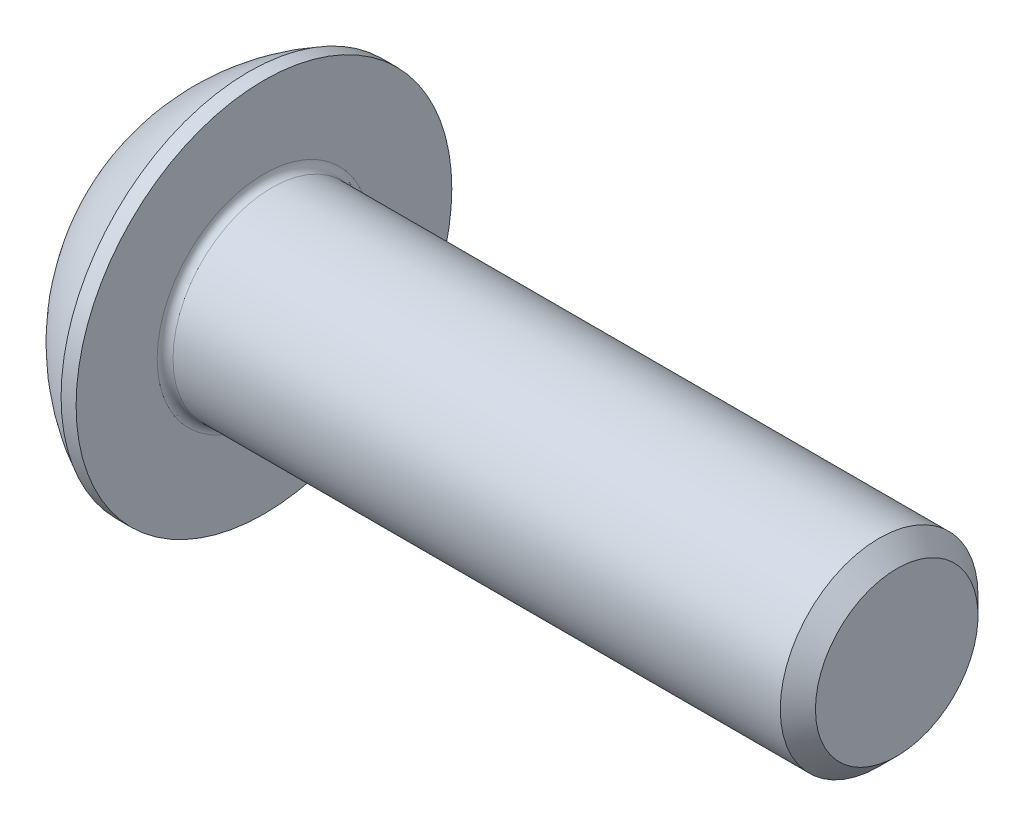
ISO-10303-21;
HEADER;
FILE_DESCRIPTION(('STEP AP214'),'2;1');
FILE_NAME('part.step','',(''),(''),'','','');
FILE_SCHEMA(('AUTOMOTIVE_DESIGN { 1 0 10303 214 1 1 1 1 }'));
ENDSEC;
DATA;
#1=APPLICATION_CONTEXT('core data for automotive mechanical design processes');
#2=APPLICATION_PROTOCOL_DEFINITION('international standard','automotive_design',2000,#1);
#3=PRODUCT_CONTEXT('',#1,'mechanical');
#4=PRODUCT('Part','Part','',(#3));
#5=PRODUCT_RELATED_PRODUCT_CATEGORY('part','',(#4));
#6=PRODUCT_DEFINITION_FORMATION('','',#4);
#7=PRODUCT_DEFINITION_CONTEXT('part definition',#1,'design');
#8=PRODUCT_DEFINITION('design','',#6,#7);
#9=PRODUCT_DEFINITION_SHAPE('','',#8);
#10=(LENGTH_UNIT() NAMED_UNIT(*) SI_UNIT(.MILLI.,.METRE.));
#11=(NAMED_UNIT(*) PLANE_ANGLE_UNIT() SI_UNIT($,.RADIAN.));
#12=(NAMED_UNIT(*) SI_UNIT($,.STERADIAN.) SOLID_ANGLE_UNIT());
#13=UNCERTAINTY_MEASURE_WITH_UNIT(LENGTH_MEASURE(1.E-05),#10,'distance_accuracy_value','');
#14=(GEOMETRIC_REPRESENTATION_CONTEXT(3) GLOBAL_UNCERTAINTY_ASSIGNED_CONTEXT((#13)) GLOBAL_UNIT_ASSIGNED_CONTEXT((#10,
#11,#12)) REPRESENTATION_CONTEXT('',''));
#15=CARTESIAN_POINT('',(0.,0.,0.));
#16=DIRECTION('',(0.,0.,1.));
#17=DIRECTION('',(1.,0.,0.));
#18=AXIS2_PLACEMENT_3D('',#15,#16,#17);
#19=CARTESIAN_POINT('',(0.,0.,0.));
#20=DIRECTION('',(-1.,0.,0.));
#21=DIRECTION('',(0.,0.,1.));
#22=AXIS2_PLACEMENT_3D('',#19,#20,#21);
#23=PLANE('',#22);
#24=CARTESIAN_POINT('',(0.,0.,0.));
#25=DIRECTION('',(-1.,0.,0.));
#26=DIRECTION('',(0.,0.,1.));
#27=AXIS2_PLACEMENT_3D('',#24,#25,#26);
#28=CIRCLE('',#27,2.375);
#29=CARTESIAN_POINT('',(0.,0.,2.375));
#30=VERTEX_POINT('',#29);
#31=EDGE_CURVE('E160',#30,#30,#28,.T.);
#32=ORIENTED_EDGE('',*,*,#31,.T.);
#33=EDGE_LOOP('',(#32));
#34=FACE_BOUND('',#33,.T.);
#35=DIRECTION('',(0.,-1.,0.));
#36=VECTOR('',#35,1.);
#37=CARTESIAN_POINT('',(0.,-0.866025403784438,1.5));
#38=LINE('',#37,#36);
#39=CARTESIAN_POINT('',(0.,0.86602540378444,1.5));
#40=VERTEX_POINT('',#39);
#41=CARTESIAN_POINT('',(0.,-0.866025403784438,1.5));
#42=VERTEX_POINT('',#41);
#43=EDGE_CURVE('E50',#40,#42,#38,.T.);
#44=ORIENTED_EDGE('',*,*,#43,.T.);
#45=DIRECTION('',(0.,-0.5,-0.866025403784439));
#46=VECTOR('',#45,1.);
#47=CARTESIAN_POINT('',(0.,-1.73205080756888,0.));
#48=LINE('',#47,#46);
#49=CARTESIAN_POINT('',(0.,-1.73205080756888,0.));
#50=VERTEX_POINT('',#49);
#51=EDGE_CURVE('E253',#42,#50,#48,.T.);
#52=ORIENTED_EDGE('',*,*,#51,.T.);
#53=DIRECTION('',(0.,0.5,-0.866025403784439));
#54=VECTOR('',#53,1.);
#55=CARTESIAN_POINT('',(0.,-0.866025403784438,-1.5));
#56=LINE('',#55,#54);
#57=CARTESIAN_POINT('',(0.,-0.866025403784438,-1.5));
#58=VERTEX_POINT('',#57);
#59=EDGE_CURVE('E135',#50,#58,#56,.T.);
#60=ORIENTED_EDGE('',*,*,#59,.T.);
#61=DIRECTION('',(0.,1.,0.));
#62=VECTOR('',#61,1.);
#63=CARTESIAN_POINT('',(0.,0.86602540378444,-1.5));
#64=LINE('',#63,#62);
#65=CARTESIAN_POINT('',(0.,0.86602540378444,-1.5));
#66=VERTEX_POINT('',#65);
#67=EDGE_CURVE('E256',#58,#66,#64,.T.);
#68=ORIENTED_EDGE('',*,*,#67,.T.);
#69=DIRECTION('',(0.,0.5,0.866025403784439));
#70=VECTOR('',#69,1.);
#71=CARTESIAN_POINT('',(0.,1.73205080756888,0.));
#72=LINE('',#71,#70);
#73=CARTESIAN_POINT('',(0.,1.73205080756888,0.));
#74=VERTEX_POINT('',#73);
#75=EDGE_CURVE('E258',#66,#74,#72,.T.);
#76=ORIENTED_EDGE('',*,*,#75,.T.);
#77=DIRECTION('',(0.,-0.5,0.866025403784438));
#78=VECTOR('',#77,1.);
#79=CARTESIAN_POINT('',(0.,0.86602540378444,1.5));
#80=LINE('',#79,#78);
#81=EDGE_CURVE('E260',#74,#40,#80,.T.);
#82=ORIENTED_EDGE('',*,*,#81,.T.);
#83=EDGE_LOOP('',(#44,#52,#60,#68,#76,#82));
#84=FACE_BOUND('',#83,.T.);
#85=ADVANCED_FACE('F35',(#34,#84),#23,.T.);
#86=CARTESIAN_POINT('',(4.75501582278481,0.,0.));
#87=DIRECTION('',(-1.,0.,0.));
#88=DIRECTION('',(0.,1.,0.));
#89=AXIS2_PLACEMENT_3D('',#86,#87,#88);
#90=SPHERICAL_SURFACE('',#89,5.3151482081814);
#91=CARTESIAN_POINT('',(2.37,0.,0.));
#92=DIRECTION('',(-1.,0.,0.));
#93=DIRECTION('',(0.,0.,1.));
#94=AXIS2_PLACEMENT_3D('',#91,#92,#93);
#95=CIRCLE('',#94,4.75);
#96=CARTESIAN_POINT('',(2.37,0.,4.75));
#97=VERTEX_POINT('',#96);
#98=EDGE_CURVE('E157',#97,#97,#95,.T.);
#99=ORIENTED_EDGE('',*,*,#98,.T.);
#100=EDGE_LOOP('',(#99));
#101=FACE_BOUND('',#100,.T.);
#102=ORIENTED_EDGE('',*,*,#31,.F.);
#103=EDGE_LOOP('',(#102));
#104=FACE_BOUND('',#103,.T.);
#105=ADVANCED_FACE('F181',(#101,#104),#90,.T.);
#106=CARTESIAN_POINT('',(0.,0.,0.));
#107=DIRECTION('',(-1.,0.,0.));
#108=DIRECTION('',(0.,0.,1.));
#109=AXIS2_PLACEMENT_3D('',#106,#107,#108);
#110=CYLINDRICAL_SURFACE('',#109,4.75);
#111=ORIENTED_EDGE('',*,*,#98,.F.);
#112=EDGE_LOOP('',(#111));
#113=FACE_BOUND('',#112,.T.);
#114=CARTESIAN_POINT('',(2.75,0.,0.));
#115=DIRECTION('',(-1.,0.,0.));
#116=DIRECTION('',(0.,0.,1.));
#117=AXIS2_PLACEMENT_3D('',#114,#115,#116);
#118=CIRCLE('',#117,4.75);
#119=CARTESIAN_POINT('',(2.75,0.,4.75));
#120=VERTEX_POINT('',#119);
#121=EDGE_CURVE('E154',#120,#120,#118,.T.);
#122=ORIENTED_EDGE('',*,*,#121,.T.);
#123=EDGE_LOOP('',(#122));
#124=FACE_BOUND('',#123,.T.);
#125=ADVANCED_FACE('F186',(#113,#124),#110,.T.);
#126=CARTESIAN_POINT('',(2.75,2.5,0.));
#127=DIRECTION('',(-1.,0.,0.));
#128=DIRECTION('',(0.,0.,1.));
#129=AXIS2_PLACEMENT_3D('',#126,#127,#128);
#130=PLANE('',#129);
#131=CARTESIAN_POINT('',(2.75,0.,0.));
#132=DIRECTION('',(-1.,0.,0.));
#133=DIRECTION('',(0.,0.,1.));
#134=AXIS2_PLACEMENT_3D('',#131,#132,#133);
#135=CIRCLE('',#134,2.7);
#136=CARTESIAN_POINT('',(2.75,0.,2.7));
#137=VERTEX_POINT('',#136);
#138=EDGE_CURVE('E43',#137,#137,#135,.T.);
#139=ORIENTED_EDGE('',*,*,#138,.T.);
#140=EDGE_LOOP('',(#139));
#141=FACE_BOUND('',#140,.T.);
#142=ORIENTED_EDGE('',*,*,#121,.F.);
#143=EDGE_LOOP('',(#142));
#144=FACE_BOUND('',#143,.T.);
#145=ADVANCED_FACE('F165',(#141,#144),#130,.F.);
#146=CARTESIAN_POINT('',(0.,0.,0.));
#147=DIRECTION('',(-1.,0.,0.));
#148=DIRECTION('',(0.,0.,1.));
#149=AXIS2_PLACEMENT_3D('',#146,#147,#148);
#150=CYLINDRICAL_SURFACE('',#149,2.5);
#151=CARTESIAN_POINT('',(2.95,0.,0.));
#152=DIRECTION('',(-1.,0.,0.));
#153=DIRECTION('',(0.,0.,1.));
#154=AXIS2_PLACEMENT_3D('',#151,#152,#153);
#155=CIRCLE('',#154,2.5);
#156=CARTESIAN_POINT('',(2.95,0.,2.5));
#157=VERTEX_POINT('',#156);
#158=EDGE_CURVE('E11',#157,#157,#155,.F.);
#159=ORIENTED_EDGE('',*,*,#158,.T.);
#160=EDGE_LOOP('',(#159));
#161=FACE_BOUND('',#160,.T.);
#162=CARTESIAN_POINT('',(18.305,0.,0.));
#163=DIRECTION('',(-1.,0.,0.));
#164=DIRECTION('',(0.,0.,1.));
#165=AXIS2_PLACEMENT_3D('',#162,#163,#164);
#166=CIRCLE('',#165,2.5);
#167=CARTESIAN_POINT('',(18.305,0.,2.5));
#168=VERTEX_POINT('',#167);
#169=EDGE_CURVE('E151',#168,#168,#166,.T.);
#170=ORIENTED_EDGE('',*,*,#169,.T.);
#171=EDGE_LOOP('',(#170));
#172=FACE_BOUND('',#171,.T.);
#173=ADVANCED_FACE('F195',(#161,#172),#150,.T.);
#174=CARTESIAN_POINT('',(18.75,0.,0.));
#175=DIRECTION('',(-1.,0.,0.));
#176=DIRECTION('',(0.,0.,1.));
#177=AXIS2_PLACEMENT_3D('',#174,#175,#176);
#178=CONICAL_SURFACE('',#177,2.055,0.785398163397443);
#179=ORIENTED_EDGE('',*,*,#169,.F.);
#180=EDGE_LOOP('',(#179));
#181=FACE_BOUND('',#180,.T.);
#182=CARTESIAN_POINT('',(18.75,0.,0.));
#183=DIRECTION('',(-1.,0.,0.));
#184=DIRECTION('',(0.,0.,1.));
#185=AXIS2_PLACEMENT_3D('',#182,#183,#184);
#186=CIRCLE('',#185,2.055);
#187=CARTESIAN_POINT('',(18.75,0.,2.055));
#188=VERTEX_POINT('',#187);
#189=EDGE_CURVE('E147',#188,#188,#186,.T.);
#190=ORIENTED_EDGE('',*,*,#189,.T.);
#191=EDGE_LOOP('',(#190));
#192=FACE_BOUND('',#191,.T.);
#193=ADVANCED_FACE('F176',(#181,#192),#178,.T.);
#194=CARTESIAN_POINT('',(18.75,0.,0.));
#195=DIRECTION('',(-1.,0.,0.));
#196=DIRECTION('',(0.,0.,1.));
#197=AXIS2_PLACEMENT_3D('',#194,#195,#196);
#198=PLANE('',#197);
#199=ORIENTED_EDGE('',*,*,#189,.F.);
#200=EDGE_LOOP('',(#199));
#201=FACE_BOUND('',#200,.T.);
#202=ADVANCED_FACE('F169',(#201),#198,.F.);
#203=CARTESIAN_POINT('',(2.95,0.,0.));
#204=DIRECTION('',(-1.,0.,0.));
#205=DIRECTION('',(0.,0.,1.));
#206=AXIS2_PLACEMENT_3D('',#203,#204,#205);
#207=TOROIDAL_SURFACE('',#206,2.7,0.2);
#208=ORIENTED_EDGE('',*,*,#158,.F.);
#209=EDGE_LOOP('',(#208));
#210=FACE_BOUND('',#209,.T.);
#211=ORIENTED_EDGE('',*,*,#138,.F.);
#212=EDGE_LOOP('',(#211));
#213=FACE_BOUND('',#212,.T.);
#214=ADVANCED_FACE('F37',(#210,#213),#207,.F.);
#215=CARTESIAN_POINT('',(1.56,-1.73205080756888,0.));
#216=DIRECTION('',(0.,0.866025403784438,-0.5));
#217=DIRECTION('',(0.,0.5,0.866025403784438));
#218=AXIS2_PLACEMENT_3D('',#215,#216,#217);
#219=PLANE('',#218);
#220=DIRECTION('',(0.,-0.5,-0.866025403784439));
#221=VECTOR('',#220,1.);
#222=CARTESIAN_POINT('',(1.56,-1.73205080756888,0.));
#223=LINE('',#222,#221);
#224=CARTESIAN_POINT('',(1.56,-0.866025403784438,1.5));
#225=VERTEX_POINT('',#224);
#226=CARTESIAN_POINT('',(1.56,-1.29903810567666,0.75));
#227=VERTEX_POINT('',#226);
#228=EDGE_CURVE('E118',#225,#227,#223,.T.);
#229=ORIENTED_EDGE('',*,*,#228,.T.);
#230=CARTESIAN_POINT('',(1.56,-1.73205080756888,0.));
#231=VERTEX_POINT('',#230);
#232=EDGE_CURVE('E111',#227,#231,#223,.T.);
#233=ORIENTED_EDGE('',*,*,#232,.T.);
#234=DIRECTION('',(-1.,0.,0.));
#235=VECTOR('',#234,1.);
#236=CARTESIAN_POINT('',(1.56,-1.73205080756888,0.));
#237=LINE('',#236,#235);
#238=EDGE_CURVE('E115',#231,#50,#237,.T.);
#239=ORIENTED_EDGE('',*,*,#238,.T.);
#240=ORIENTED_EDGE('',*,*,#51,.F.);
#241=DIRECTION('',(-1.,0.,0.));
#242=VECTOR('',#241,1.);
#243=CARTESIAN_POINT('',(1.56,-0.866025403784438,1.5));
#244=LINE('',#243,#242);
#245=EDGE_CURVE('E243',#225,#42,#244,.T.);
#246=ORIENTED_EDGE('',*,*,#245,.F.);
#247=EDGE_LOOP('',(#229,#233,#239,#240,#246));
#248=FACE_BOUND('',#247,.T.);
#249=ADVANCED_FACE('F113',(#248),#219,.T.);
#250=CARTESIAN_POINT('',(1.56,-0.866025403784438,-1.5));
#251=DIRECTION('',(0.,0.866025403784438,0.5));
#252=DIRECTION('',(0.,-0.5,0.866025403784438));
#253=AXIS2_PLACEMENT_3D('',#250,#251,#252);
#254=PLANE('',#253);
#255=DIRECTION('',(0.,0.5,-0.866025403784439));
#256=VECTOR('',#255,1.);
#257=CARTESIAN_POINT('',(1.56,-0.866025403784438,-1.5));
#258=LINE('',#257,#256);
#259=CARTESIAN_POINT('',(1.56,-1.29903810567666,-0.75));
#260=VERTEX_POINT('',#259);
#261=EDGE_CURVE('E123',#231,#260,#258,.T.);
#262=ORIENTED_EDGE('',*,*,#261,.T.);
#263=CARTESIAN_POINT('',(1.56,-0.866025403784438,-1.5));
#264=VERTEX_POINT('',#263);
#265=EDGE_CURVE('E130',#260,#264,#258,.T.);
#266=ORIENTED_EDGE('',*,*,#265,.T.);
#267=DIRECTION('',(-1.,0.,0.));
#268=VECTOR('',#267,1.);
#269=CARTESIAN_POINT('',(1.56,-0.866025403784438,-1.5));
#270=LINE('',#269,#268);
#271=EDGE_CURVE('E137',#264,#58,#270,.T.);
#272=ORIENTED_EDGE('',*,*,#271,.T.);
#273=ORIENTED_EDGE('',*,*,#59,.F.);
#274=ORIENTED_EDGE('',*,*,#238,.F.);
#275=EDGE_LOOP('',(#262,#266,#272,#273,#274));
#276=FACE_BOUND('',#275,.T.);
#277=ADVANCED_FACE('F133',(#276),#254,.T.);
#278=CARTESIAN_POINT('',(1.56,0.86602540378444,-1.5));
#279=DIRECTION('',(0.,0.,1.));
#280=DIRECTION('',(1.,0.,0.));
#281=AXIS2_PLACEMENT_3D('',#278,#279,#280);
#282=PLANE('',#281);
#283=DIRECTION('',(0.,1.,0.));
#284=VECTOR('',#283,1.);
#285=CARTESIAN_POINT('',(1.56,0.86602540378444,-1.5));
#286=LINE('',#285,#284);
#287=CARTESIAN_POINT('',(1.56,0.,-1.5));
#288=VERTEX_POINT('',#287);
#289=EDGE_CURVE('E279',#264,#288,#286,.T.);
#290=ORIENTED_EDGE('',*,*,#289,.T.);
#291=CARTESIAN_POINT('',(1.56,0.86602540378444,-1.5));
#292=VERTEX_POINT('',#291);
#293=EDGE_CURVE('E129',#288,#292,#286,.T.);
#294=ORIENTED_EDGE('',*,*,#293,.T.);
#295=DIRECTION('',(-1.,0.,0.));
#296=VECTOR('',#295,1.);
#297=CARTESIAN_POINT('',(1.56,0.86602540378444,-1.5));
#298=LINE('',#297,#296);
#299=EDGE_CURVE('E142',#292,#66,#298,.T.);
#300=ORIENTED_EDGE('',*,*,#299,.T.);
#301=ORIENTED_EDGE('',*,*,#67,.F.);
#302=ORIENTED_EDGE('',*,*,#271,.F.);
#303=EDGE_LOOP('',(#290,#294,#300,#301,#302));
#304=FACE_BOUND('',#303,.T.);
#305=ADVANCED_FACE('F209',(#304),#282,.T.);
#306=CARTESIAN_POINT('',(1.56,1.73205080756888,0.));
#307=DIRECTION('',(0.,-0.866025403784439,0.5));
#308=DIRECTION('',(0.,-0.5,-0.866025403784439));
#309=AXIS2_PLACEMENT_3D('',#306,#307,#308);
#310=PLANE('',#309);
#311=DIRECTION('',(0.,0.5,0.866025403784439));
#312=VECTOR('',#311,1.);
#313=CARTESIAN_POINT('',(1.56,1.73205080756888,0.));
#314=LINE('',#313,#312);
#315=CARTESIAN_POINT('',(1.56,1.29903810567666,-0.750000000000001));
#316=VERTEX_POINT('',#315);
#317=EDGE_CURVE('E285',#292,#316,#314,.T.);
#318=ORIENTED_EDGE('',*,*,#317,.T.);
#319=CARTESIAN_POINT('',(1.56,1.73205080756888,0.));
#320=VERTEX_POINT('',#319);
#321=EDGE_CURVE('E283',#316,#320,#314,.T.);
#322=ORIENTED_EDGE('',*,*,#321,.T.);
#323=DIRECTION('',(-1.,0.,0.));
#324=VECTOR('',#323,1.);
#325=CARTESIAN_POINT('',(1.56,1.73205080756888,0.));
#326=LINE('',#325,#324);
#327=EDGE_CURVE('E265',#320,#74,#326,.T.);
#328=ORIENTED_EDGE('',*,*,#327,.T.);
#329=ORIENTED_EDGE('',*,*,#75,.F.);
#330=ORIENTED_EDGE('',*,*,#299,.F.);
#331=EDGE_LOOP('',(#318,#322,#328,#329,#330));
#332=FACE_BOUND('',#331,.T.);
#333=ADVANCED_FACE('F212',(#332),#310,.T.);
#334=CARTESIAN_POINT('',(1.56,0.86602540378444,1.5));
#335=DIRECTION('',(0.,-0.866025403784438,-0.5));
#336=DIRECTION('',(0.,0.5,-0.866025403784439));
#337=AXIS2_PLACEMENT_3D('',#334,#335,#336);
#338=PLANE('',#337);
#339=DIRECTION('',(0.,-0.5,0.866025403784438));
#340=VECTOR('',#339,1.);
#341=CARTESIAN_POINT('',(1.56,0.86602540378444,1.5));
#342=LINE('',#341,#340);
#343=CARTESIAN_POINT('',(1.56,1.29903810567666,0.750000000000001));
#344=VERTEX_POINT('',#343);
#345=EDGE_CURVE('E249',#320,#344,#342,.T.);
#346=ORIENTED_EDGE('',*,*,#345,.T.);
#347=CARTESIAN_POINT('',(1.56,0.86602540378444,1.5));
#348=VERTEX_POINT('',#347);
#349=EDGE_CURVE('E241',#344,#348,#342,.T.);
#350=ORIENTED_EDGE('',*,*,#349,.T.);
#351=DIRECTION('',(-1.,0.,0.));
#352=VECTOR('',#351,1.);
#353=CARTESIAN_POINT('',(1.56,0.86602540378444,1.5));
#354=LINE('',#353,#352);
#355=EDGE_CURVE('E247',#348,#40,#354,.T.);
#356=ORIENTED_EDGE('',*,*,#355,.T.);
#357=ORIENTED_EDGE('',*,*,#81,.F.);
#358=ORIENTED_EDGE('',*,*,#327,.F.);
#359=EDGE_LOOP('',(#346,#350,#356,#357,#358));
#360=FACE_BOUND('',#359,.T.);
#361=ADVANCED_FACE('F216',(#360),#338,.T.);
#362=CARTESIAN_POINT('',(1.56,-0.866025403784438,1.5));
#363=DIRECTION('',(0.,0.,-1.));
#364=DIRECTION('',(0.,1.,0.));
#365=AXIS2_PLACEMENT_3D('',#362,#363,#364);
#366=PLANE('',#365);
#367=DIRECTION('',(0.,-1.,0.));
#368=VECTOR('',#367,1.);
#369=CARTESIAN_POINT('',(1.56,-0.866025403784438,1.5));
#370=LINE('',#369,#368);
#371=CARTESIAN_POINT('',(1.56,0.,1.5));
#372=VERTEX_POINT('',#371);
#373=EDGE_CURVE('E58',#348,#372,#370,.T.);
#374=ORIENTED_EDGE('',*,*,#373,.T.);
#375=EDGE_CURVE('E244',#372,#225,#370,.T.);
#376=ORIENTED_EDGE('',*,*,#375,.T.);
#377=ORIENTED_EDGE('',*,*,#245,.T.);
#378=ORIENTED_EDGE('',*,*,#43,.F.);
#379=ORIENTED_EDGE('',*,*,#355,.F.);
#380=EDGE_LOOP('',(#374,#376,#377,#378,#379));
#381=FACE_BOUND('',#380,.T.);
#382=ADVANCED_FACE('F220',(#381),#366,.T.);
#383=CARTESIAN_POINT('',(1.56,0.,3.));
#384=DIRECTION('',(-1.,0.,0.));
#385=DIRECTION('',(0.,0.,1.));
#386=AXIS2_PLACEMENT_3D('',#383,#384,#385);
#387=PLANE('',#386);
#388=ORIENTED_EDGE('',*,*,#373,.F.);
#389=ORIENTED_EDGE('',*,*,#349,.F.);
#390=CARTESIAN_POINT('',(1.56,0.,0.));
#391=DIRECTION('',(-1.,0.,0.));
#392=DIRECTION('',(0.,0.,1.));
#393=AXIS2_PLACEMENT_3D('',#390,#391,#392);
#394=CIRCLE('',#393,1.5);
#395=EDGE_CURVE('E141',#372,#344,#394,.T.);
#396=ORIENTED_EDGE('',*,*,#395,.F.);
#397=EDGE_LOOP('',(#388,#389,#396));
#398=FACE_BOUND('',#397,.T.);
#399=ADVANCED_FACE('F224',(#398),#387,.T.);
#400=ORIENTED_EDGE('',*,*,#345,.F.);
#401=ORIENTED_EDGE('',*,*,#321,.F.);
#402=EDGE_CURVE('E148',#344,#316,#394,.T.);
#403=ORIENTED_EDGE('',*,*,#402,.F.);
#404=EDGE_LOOP('',(#400,#401,#403));
#405=FACE_BOUND('',#404,.T.);
#406=ADVANCED_FACE('F232',(#405),#387,.T.);
#407=ORIENTED_EDGE('',*,*,#317,.F.);
#408=ORIENTED_EDGE('',*,*,#293,.F.);
#409=EDGE_CURVE('E290',#316,#288,#394,.T.);
#410=ORIENTED_EDGE('',*,*,#409,.F.);
#411=EDGE_LOOP('',(#407,#408,#410));
#412=FACE_BOUND('',#411,.T.);
#413=ADVANCED_FACE('F237',(#412),#387,.T.);
#414=ORIENTED_EDGE('',*,*,#289,.F.);
#415=ORIENTED_EDGE('',*,*,#265,.F.);
#416=EDGE_CURVE('E282',#288,#260,#394,.T.);
#417=ORIENTED_EDGE('',*,*,#416,.F.);
#418=EDGE_LOOP('',(#414,#415,#417));
#419=FACE_BOUND('',#418,.T.);
#420=ADVANCED_FACE('F230',(#419),#387,.T.);
#421=ORIENTED_EDGE('',*,*,#261,.F.);
#422=ORIENTED_EDGE('',*,*,#232,.F.);
#423=EDGE_CURVE('E125',#260,#227,#394,.T.);
#424=ORIENTED_EDGE('',*,*,#423,.F.);
#425=EDGE_LOOP('',(#421,#422,#424));
#426=FACE_BOUND('',#425,.T.);
#427=ADVANCED_FACE('F124',(#426),#387,.T.);
#428=ORIENTED_EDGE('',*,*,#228,.F.);
#429=ORIENTED_EDGE('',*,*,#375,.F.);
#430=EDGE_CURVE('E136',#227,#372,#394,.T.);
#431=ORIENTED_EDGE('',*,*,#430,.F.);
#432=EDGE_LOOP('',(#428,#429,#431));
#433=FACE_BOUND('',#432,.T.);
#434=ADVANCED_FACE('F204',(#433),#387,.T.);
#435=CARTESIAN_POINT('',(2.42602540378445,0.,0.));
#436=DIRECTION('',(-1.,0.,0.));
#437=DIRECTION('',(0.,0.,1.));
#438=AXIS2_PLACEMENT_3D('',#435,#436,#437);
#439=CONICAL_SURFACE('',#438,0.,1.04719755119659);
#440=ORIENTED_EDGE('',*,*,#395,.T.);
#441=ORIENTED_EDGE('',*,*,#402,.T.);
#442=ORIENTED_EDGE('',*,*,#409,.T.);
#443=ORIENTED_EDGE('',*,*,#416,.T.);
#444=ORIENTED_EDGE('',*,*,#423,.T.);
#445=ORIENTED_EDGE('',*,*,#430,.T.);
#446=EDGE_LOOP('',(#440,#441,#442,#443,#444,#445));
#447=FACE_BOUND('',#446,.T.);
#448=CARTESIAN_POINT('',(2.42602540378445,0.,0.));
#449=VERTEX_POINT('',#448);
#450=VERTEX_LOOP('',#449);
#451=FACE_BOUND('',#450,.T.);
#452=ADVANCED_FACE('F202',(#447,#451),#439,.F.);
#453=CLOSED_SHELL('',(#85,#105,#125,#145,#173,#193,#202,#214,#249,#277,#305,#333,#361,#382,#399,
#406,#413,#420,#427,#434,#452));
#454=MANIFOLD_SOLID_BREP('B2',#453);
#455=ADVANCED_BREP_SHAPE_REPRESENTATION('',(#18,#454),#14);
#456=SHAPE_DEFINITION_REPRESENTATION(#9,#455);
ENDSEC;
END-ISO-10303-21;
